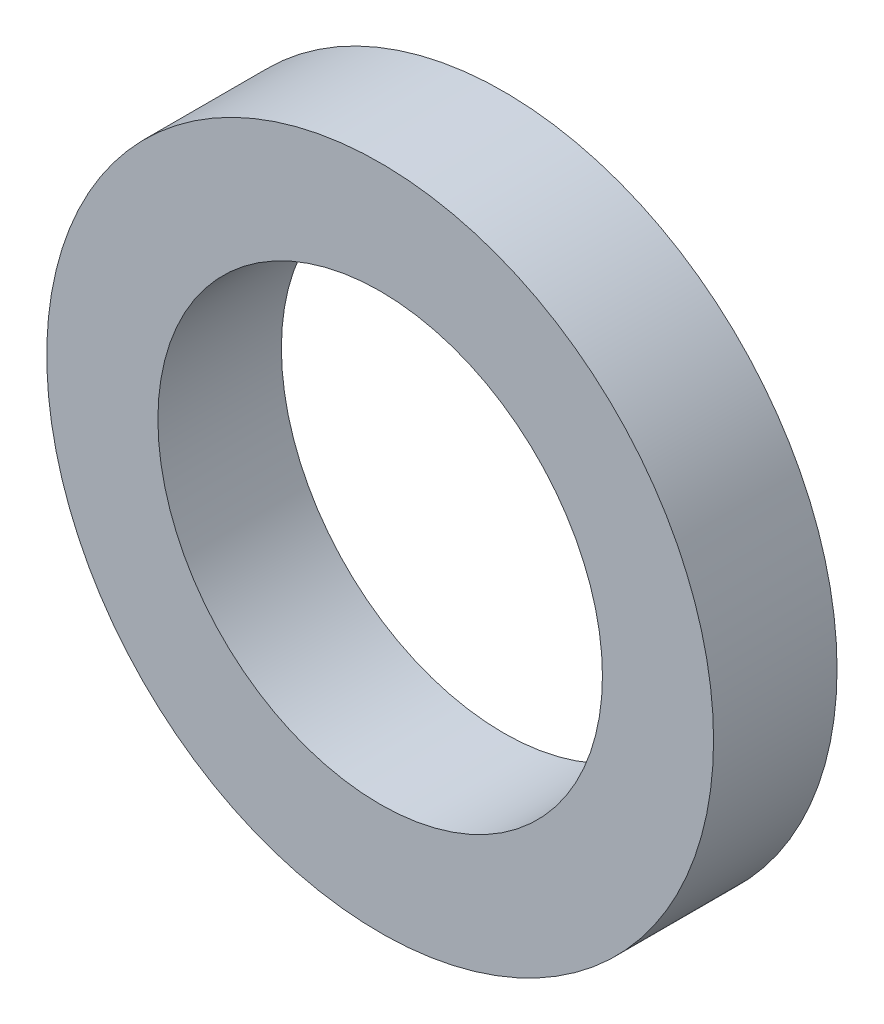
ISO-10303-21;
HEADER;
FILE_DESCRIPTION(('STEP AP214'),'2;1');
FILE_NAME('part.step','',(''),(''),'','','');
FILE_SCHEMA(('AUTOMOTIVE_DESIGN { 1 0 10303 214 1 1 1 1 }'));
ENDSEC;
DATA;
#1=APPLICATION_CONTEXT('core data for automotive mechanical design processes');
#2=APPLICATION_PROTOCOL_DEFINITION('international standard','automotive_design',2000,#1);
#3=PRODUCT_CONTEXT('',#1,'mechanical');
#4=PRODUCT('Part','Part','',(#3));
#5=PRODUCT_RELATED_PRODUCT_CATEGORY('part','',(#4));
#6=PRODUCT_DEFINITION_FORMATION('','',#4);
#7=PRODUCT_DEFINITION_CONTEXT('part definition',#1,'design');
#8=PRODUCT_DEFINITION('design','',#6,#7);
#9=PRODUCT_DEFINITION_SHAPE('','',#8);
#10=(LENGTH_UNIT() NAMED_UNIT(*) SI_UNIT(.MILLI.,.METRE.));
#11=(NAMED_UNIT(*) PLANE_ANGLE_UNIT() SI_UNIT($,.RADIAN.));
#12=(NAMED_UNIT(*) SI_UNIT($,.STERADIAN.) SOLID_ANGLE_UNIT());
#13=UNCERTAINTY_MEASURE_WITH_UNIT(LENGTH_MEASURE(1.E-05),#10,'distance_accuracy_value','');
#14=(GEOMETRIC_REPRESENTATION_CONTEXT(3) GLOBAL_UNCERTAINTY_ASSIGNED_CONTEXT((#13)) GLOBAL_UNIT_ASSIGNED_CONTEXT((#10,
#11,#12)) REPRESENTATION_CONTEXT('',''));
#15=CARTESIAN_POINT('',(0.,0.,0.));
#16=DIRECTION('',(0.,0.,1.));
#17=DIRECTION('',(1.,0.,0.));
#18=AXIS2_PLACEMENT_3D('',#15,#16,#17);
#19=CARTESIAN_POINT('',(0.,0.,1.));
#20=DIRECTION('',(0.,0.,1.));
#21=DIRECTION('',(1.,0.,0.));
#22=AXIS2_PLACEMENT_3D('',#19,#20,#21);
#23=PLANE('',#22);
#24=CARTESIAN_POINT('',(0.,0.,1.));
#25=DIRECTION('',(0.,0.,1.));
#26=DIRECTION('',(1.,0.,0.));
#27=AXIS2_PLACEMENT_3D('',#24,#25,#26);
#28=CIRCLE('',#27,2.7);
#29=CARTESIAN_POINT('',(2.7,0.,1.));
#30=VERTEX_POINT('',#29);
#31=EDGE_CURVE('E12',#30,#30,#28,.T.);
#32=ORIENTED_EDGE('',*,*,#31,.T.);
#33=EDGE_LOOP('',(#32));
#34=FACE_BOUND('',#33,.T.);
#35=CARTESIAN_POINT('',(0.,0.,1.));
#36=DIRECTION('',(0.,0.,1.));
#37=DIRECTION('',(1.,0.,0.));
#38=AXIS2_PLACEMENT_3D('',#35,#36,#37);
#39=CIRCLE('',#38,1.8);
#40=CARTESIAN_POINT('',(1.8,0.,1.));
#41=VERTEX_POINT('',#40);
#42=EDGE_CURVE('E53',#41,#41,#39,.T.);
#43=ORIENTED_EDGE('',*,*,#42,.F.);
#44=EDGE_LOOP('',(#43));
#45=FACE_BOUND('',#44,.T.);
#46=ADVANCED_FACE('F42',(#34,#45),#23,.T.);
#47=CARTESIAN_POINT('',(0.,0.,0.));
#48=DIRECTION('',(0.,0.,1.));
#49=DIRECTION('',(1.,0.,0.));
#50=AXIS2_PLACEMENT_3D('',#47,#48,#49);
#51=PLANE('',#50);
#52=CARTESIAN_POINT('',(0.,0.,0.));
#53=DIRECTION('',(0.,0.,1.));
#54=DIRECTION('',(1.,0.,0.));
#55=AXIS2_PLACEMENT_3D('',#52,#53,#54);
#56=CIRCLE('',#55,2.7);
#57=CARTESIAN_POINT('',(2.7,0.,0.));
#58=VERTEX_POINT('',#57);
#59=EDGE_CURVE('E46',#58,#58,#56,.T.);
#60=ORIENTED_EDGE('',*,*,#59,.F.);
#61=EDGE_LOOP('',(#60));
#62=FACE_BOUND('',#61,.T.);
#63=CARTESIAN_POINT('',(0.,0.,0.));
#64=DIRECTION('',(0.,0.,1.));
#65=DIRECTION('',(1.,0.,0.));
#66=AXIS2_PLACEMENT_3D('',#63,#64,#65);
#67=CIRCLE('',#66,1.8);
#68=CARTESIAN_POINT('',(1.8,0.,0.));
#69=VERTEX_POINT('',#68);
#70=EDGE_CURVE('E55',#69,#69,#67,.T.);
#71=ORIENTED_EDGE('',*,*,#70,.T.);
#72=EDGE_LOOP('',(#71));
#73=FACE_BOUND('',#72,.T.);
#74=ADVANCED_FACE('F65',(#62,#73),#51,.F.);
#75=CARTESIAN_POINT('',(0.,0.,1.));
#76=DIRECTION('',(0.,0.,-1.));
#77=DIRECTION('',(-1.,0.,0.));
#78=AXIS2_PLACEMENT_3D('',#75,#76,#77);
#79=CYLINDRICAL_SURFACE('',#78,2.7);
#80=ORIENTED_EDGE('',*,*,#31,.F.);
#81=EDGE_LOOP('',(#80));
#82=FACE_BOUND('',#81,.T.);
#83=ORIENTED_EDGE('',*,*,#59,.T.);
#84=EDGE_LOOP('',(#83));
#85=FACE_BOUND('',#84,.T.);
#86=ADVANCED_FACE('F44',(#82,#85),#79,.T.);
#87=CARTESIAN_POINT('',(0.,0.,1.));
#88=DIRECTION('',(0.,0.,-1.));
#89=DIRECTION('',(-1.,0.,0.));
#90=AXIS2_PLACEMENT_3D('',#87,#88,#89);
#91=CYLINDRICAL_SURFACE('',#90,1.8);
#92=ORIENTED_EDGE('',*,*,#42,.T.);
#93=EDGE_LOOP('',(#92));
#94=FACE_BOUND('',#93,.T.);
#95=ORIENTED_EDGE('',*,*,#70,.F.);
#96=EDGE_LOOP('',(#95));
#97=FACE_BOUND('',#96,.T.);
#98=ADVANCED_FACE('F61',(#94,#97),#91,.F.);
#99=CLOSED_SHELL('',(#46,#74,#86,#98));
#100=MANIFOLD_SOLID_BREP('B2',#99);
#101=ADVANCED_BREP_SHAPE_REPRESENTATION('',(#18,#100),#14);
#102=SHAPE_DEFINITION_REPRESENTATION(#9,#101);
ENDSEC;
END-ISO-10303-21;
